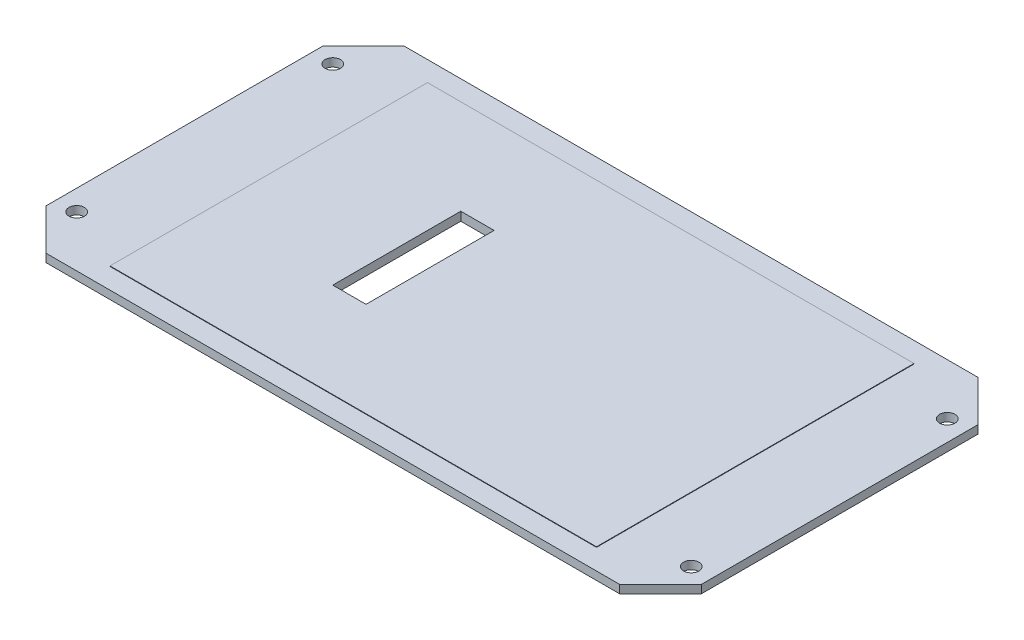
ISO-10303-21;
HEADER;
FILE_DESCRIPTION(('STEP AP214'),'2;1');
FILE_NAME('part.step','',(''),(''),'','','');
FILE_SCHEMA(('AUTOMOTIVE_DESIGN { 1 0 10303 214 1 1 1 1 }'));
ENDSEC;
DATA;
#1=APPLICATION_CONTEXT('core data for automotive mechanical design processes');
#2=APPLICATION_PROTOCOL_DEFINITION('international standard','automotive_design',2000,#1);
#3=PRODUCT_CONTEXT('',#1,'mechanical');
#4=PRODUCT('Part','Part','',(#3));
#5=PRODUCT_RELATED_PRODUCT_CATEGORY('part','',(#4));
#6=PRODUCT_DEFINITION_FORMATION('','',#4);
#7=PRODUCT_DEFINITION_CONTEXT('part definition',#1,'design');
#8=PRODUCT_DEFINITION('design','',#6,#7);
#9=PRODUCT_DEFINITION_SHAPE('','',#8);
#10=(LENGTH_UNIT() NAMED_UNIT(*) SI_UNIT(.MILLI.,.METRE.));
#11=(NAMED_UNIT(*) PLANE_ANGLE_UNIT() SI_UNIT($,.RADIAN.));
#12=(NAMED_UNIT(*) SI_UNIT($,.STERADIAN.) SOLID_ANGLE_UNIT());
#13=UNCERTAINTY_MEASURE_WITH_UNIT(LENGTH_MEASURE(1.E-05),#10,'distance_accuracy_value','');
#14=(GEOMETRIC_REPRESENTATION_CONTEXT(3) GLOBAL_UNCERTAINTY_ASSIGNED_CONTEXT((#13)) GLOBAL_UNIT_ASSIGNED_CONTEXT((#10,
#11,#12)) REPRESENTATION_CONTEXT('',''));
#15=CARTESIAN_POINT('',(0.,0.,0.));
#16=DIRECTION('',(0.,0.,1.));
#17=DIRECTION('',(1.,0.,0.));
#18=AXIS2_PLACEMENT_3D('',#15,#16,#17);
#19=CARTESIAN_POINT('',(1.77641068054053E-13,-25.4,0.));
#20=DIRECTION('',(0.,1.,0.));
#21=DIRECTION('',(-1.,0.,0.));
#22=AXIS2_PLACEMENT_3D('',#19,#20,#21);
#23=PLANE('',#22);
#24=CARTESIAN_POINT('',(-59.9999999999998,-25.4000000000004,25.));
#25=DIRECTION('',(0.,1.,0.));
#26=DIRECTION('',(0.,0.,1.));
#27=AXIS2_PLACEMENT_3D('',#24,#25,#26);
#28=CIRCLE('',#27,1.5);
#29=CARTESIAN_POINT('',(-59.9999999999998,-25.4000000000004,26.5));
#30=VERTEX_POINT('',#29);
#31=EDGE_CURVE('E214',#30,#30,#28,.T.);
#32=ORIENTED_EDGE('',*,*,#31,.F.);
#33=EDGE_LOOP('',(#32));
#34=FACE_BOUND('',#33,.T.);
#35=CARTESIAN_POINT('',(-59.9999999999998,-25.4000000000004,-25.));
#36=DIRECTION('',(0.,1.,0.));
#37=DIRECTION('',(0.,0.,1.));
#38=AXIS2_PLACEMENT_3D('',#35,#36,#37);
#39=CIRCLE('',#38,1.5);
#40=CARTESIAN_POINT('',(-59.9999999999998,-25.4000000000004,-23.5));
#41=VERTEX_POINT('',#40);
#42=EDGE_CURVE('E220',#41,#41,#39,.T.);
#43=ORIENTED_EDGE('',*,*,#42,.F.);
#44=EDGE_LOOP('',(#43));
#45=FACE_BOUND('',#44,.T.);
#46=CARTESIAN_POINT('',(60.0000000000002,-25.3999999999996,-25.));
#47=DIRECTION('',(0.,1.,0.));
#48=DIRECTION('',(0.,0.,1.));
#49=AXIS2_PLACEMENT_3D('',#46,#47,#48);
#50=CIRCLE('',#49,1.5);
#51=CARTESIAN_POINT('',(60.0000000000002,-25.3999999999996,-23.5));
#52=VERTEX_POINT('',#51);
#53=EDGE_CURVE('E226',#52,#52,#50,.T.);
#54=ORIENTED_EDGE('',*,*,#53,.F.);
#55=EDGE_LOOP('',(#54));
#56=FACE_BOUND('',#55,.T.);
#57=CARTESIAN_POINT('',(60.0000000000002,-25.3999999999996,25.));
#58=DIRECTION('',(0.,1.,0.));
#59=DIRECTION('',(0.,0.,1.));
#60=AXIS2_PLACEMENT_3D('',#57,#58,#59);
#61=CIRCLE('',#60,1.5);
#62=CARTESIAN_POINT('',(60.0000000000002,-25.3999999999996,26.5));
#63=VERTEX_POINT('',#62);
#64=EDGE_CURVE('E232',#63,#63,#61,.T.);
#65=ORIENTED_EDGE('',*,*,#64,.F.);
#66=EDGE_LOOP('',(#65));
#67=FACE_BOUND('',#66,.T.);
#68=DIRECTION('',(-1.,0.,0.));
#69=VECTOR('',#68,1.);
#70=CARTESIAN_POINT('',(-63.9999999999999,-25.4000000000004,-35.));
#71=LINE('',#70,#69);
#72=CARTESIAN_POINT('',(56.0000000000002,-25.3999999999996,-35.));
#73=VERTEX_POINT('',#72);
#74=CARTESIAN_POINT('',(-55.9999999999998,-25.4000000000004,-35.));
#75=VERTEX_POINT('',#74);
#76=EDGE_CURVE('E242',#73,#75,#71,.T.);
#77=ORIENTED_EDGE('',*,*,#76,.T.);
#78=DIRECTION('',(0.707106781186549,0.,-0.707106781186546));
#79=VECTOR('',#78,1.);
#80=CARTESIAN_POINT('',(-45.4999999999997,-25.4000000000003,-45.5000000000001));
#81=LINE('',#80,#79);
#82=CARTESIAN_POINT('',(-63.9999999999999,-25.4000000000004,-27.));
#83=VERTEX_POINT('',#82);
#84=EDGE_CURVE('E286',#75,#83,#81,.F.);
#85=ORIENTED_EDGE('',*,*,#84,.T.);
#86=DIRECTION('',(0.,0.,1.));
#87=VECTOR('',#86,1.);
#88=CARTESIAN_POINT('',(-63.9999999999999,-25.4000000000004,-35.));
#89=LINE('',#88,#87);
#90=CARTESIAN_POINT('',(-63.9999999999999,-25.4000000000004,26.9999999999999));
#91=VERTEX_POINT('',#90);
#92=EDGE_CURVE('E246',#83,#91,#89,.T.);
#93=ORIENTED_EDGE('',*,*,#92,.T.);
#94=DIRECTION('',(-0.707106781186546,0.,-0.707106781186549));
#95=VECTOR('',#94,1.);
#96=CARTESIAN_POINT('',(-45.5,-25.4000000000003,45.4999999999999));
#97=LINE('',#96,#95);
#98=CARTESIAN_POINT('',(-55.9999999999998,-25.4000000000004,35.));
#99=VERTEX_POINT('',#98);
#100=EDGE_CURVE('E284',#91,#99,#97,.F.);
#101=ORIENTED_EDGE('',*,*,#100,.T.);
#102=DIRECTION('',(1.,0.,0.));
#103=VECTOR('',#102,1.);
#104=CARTESIAN_POINT('',(-63.9999999999999,-25.4000000000004,35.));
#105=LINE('',#104,#103);
#106=CARTESIAN_POINT('',(56.0000000000001,-25.3999999999996,35.));
#107=VERTEX_POINT('',#106);
#108=EDGE_CURVE('E249',#99,#107,#105,.T.);
#109=ORIENTED_EDGE('',*,*,#108,.T.);
#110=DIRECTION('',(-0.707106781186549,0.,0.707106781186546));
#111=VECTOR('',#110,1.);
#112=CARTESIAN_POINT('',(45.5,-25.3999999999997,45.5000000000001));
#113=LINE('',#112,#111);
#114=CARTESIAN_POINT('',(64.0000000000002,-25.3999999999996,27.));
#115=VERTEX_POINT('',#114);
#116=EDGE_CURVE('E282',#107,#115,#113,.F.);
#117=ORIENTED_EDGE('',*,*,#116,.T.);
#118=DIRECTION('',(0.,0.,-1.));
#119=VECTOR('',#118,1.);
#120=CARTESIAN_POINT('',(64.0000000000002,-25.3999999999996,-35.));
#121=LINE('',#120,#119);
#122=CARTESIAN_POINT('',(64.0000000000002,-25.3999999999996,-27.));
#123=VERTEX_POINT('',#122);
#124=EDGE_CURVE('E239',#115,#123,#121,.T.);
#125=ORIENTED_EDGE('',*,*,#124,.T.);
#126=DIRECTION('',(0.707106781186546,0.,0.707106781186549));
#127=VECTOR('',#126,1.);
#128=CARTESIAN_POINT('',(45.5000000000003,-25.3999999999997,-45.4999999999999));
#129=LINE('',#128,#127);
#130=EDGE_CURVE('E280',#123,#73,#129,.F.);
#131=ORIENTED_EDGE('',*,*,#130,.T.);
#132=EDGE_LOOP('',(#77,#85,#93,#101,#109,#117,#125,#131));
#133=FACE_BOUND('',#132,.T.);
#134=DIRECTION('',(-1.,0.,0.));
#135=VECTOR('',#134,1.);
#136=CARTESIAN_POINT('',(-47.4999999999998,-25.4000000000003,-31.));
#137=LINE('',#136,#135);
#138=CARTESIAN_POINT('',(47.5000000000002,-25.3999999999997,-31.));
#139=VERTEX_POINT('',#138);
#140=CARTESIAN_POINT('',(-47.4999999999998,-25.4000000000003,-31.));
#141=VERTEX_POINT('',#140);
#142=EDGE_CURVE('E199',#139,#141,#137,.T.);
#143=ORIENTED_EDGE('',*,*,#142,.F.);
#144=DIRECTION('',(0.,0.,-1.));
#145=VECTOR('',#144,1.);
#146=CARTESIAN_POINT('',(47.5000000000002,-25.3999999999997,-31.));
#147=LINE('',#146,#145);
#148=CARTESIAN_POINT('',(47.5000000000002,-25.3999999999997,31.));
#149=VERTEX_POINT('',#148);
#150=EDGE_CURVE('E182',#149,#139,#147,.T.);
#151=ORIENTED_EDGE('',*,*,#150,.F.);
#152=DIRECTION('',(1.,0.,0.));
#153=VECTOR('',#152,1.);
#154=CARTESIAN_POINT('',(-47.4999999999998,-25.4000000000003,31.));
#155=LINE('',#154,#153);
#156=CARTESIAN_POINT('',(-47.4999999999998,-25.4000000000003,31.));
#157=VERTEX_POINT('',#156);
#158=EDGE_CURVE('E190',#157,#149,#155,.T.);
#159=ORIENTED_EDGE('',*,*,#158,.F.);
#160=DIRECTION('',(0.,0.,1.));
#161=VECTOR('',#160,1.);
#162=CARTESIAN_POINT('',(-47.4999999999998,-25.4000000000003,-31.));
#163=LINE('',#162,#161);
#164=EDGE_CURVE('E201',#141,#157,#163,.T.);
#165=ORIENTED_EDGE('',*,*,#164,.F.);
#166=EDGE_LOOP('',(#143,#151,#159,#165));
#167=FACE_BOUND('',#166,.T.);
#168=ADVANCED_FACE('F35',(#34,#45,#56,#67,#133,#167),#23,.T.);
#169=CARTESIAN_POINT('',(64.0000000000002,-25.3999999999996,-35.));
#170=DIRECTION('',(-1.,0.,0.));
#171=DIRECTION('',(0.,-1.,0.));
#172=AXIS2_PLACEMENT_3D('',#169,#170,#171);
#173=PLANE('',#172);
#174=ORIENTED_EDGE('',*,*,#124,.F.);
#175=DIRECTION('',(0.,-1.,0.));
#176=VECTOR('',#175,1.);
#177=CARTESIAN_POINT('',(64.0000000000002,-25.3999999999996,27.));
#178=LINE('',#177,#176);
#179=CARTESIAN_POINT('',(64.0000000000002,-26.9999999999996,27.));
#180=VERTEX_POINT('',#179);
#181=EDGE_CURVE('E11',#115,#180,#178,.T.);
#182=ORIENTED_EDGE('',*,*,#181,.T.);
#183=DIRECTION('',(0.,0.,-1.));
#184=VECTOR('',#183,1.);
#185=CARTESIAN_POINT('',(64.0000000000002,-26.9999999999996,-35.));
#186=LINE('',#185,#184);
#187=CARTESIAN_POINT('',(64.0000000000002,-26.9999999999996,-27.));
#188=VERTEX_POINT('',#187);
#189=EDGE_CURVE('E238',#180,#188,#186,.T.);
#190=ORIENTED_EDGE('',*,*,#189,.T.);
#191=DIRECTION('',(0.,1.,0.));
#192=VECTOR('',#191,1.);
#193=CARTESIAN_POINT('',(64.0000000000002,-25.3999999999996,-27.));
#194=LINE('',#193,#192);
#195=EDGE_CURVE('E44',#188,#123,#194,.T.);
#196=ORIENTED_EDGE('',*,*,#195,.T.);
#197=EDGE_LOOP('',(#174,#182,#190,#196));
#198=FACE_BOUND('',#197,.T.);
#199=ADVANCED_FACE('F295',(#198),#173,.F.);
#200=CARTESIAN_POINT('',(-63.9999999999999,-25.4000000000004,-35.));
#201=DIRECTION('',(0.,0.,1.));
#202=DIRECTION('',(1.,0.,0.));
#203=AXIS2_PLACEMENT_3D('',#200,#201,#202);
#204=PLANE('',#203);
#205=DIRECTION('',(-1.,0.,0.));
#206=VECTOR('',#205,1.);
#207=CARTESIAN_POINT('',(-63.9999999999998,-27.0000000000004,-35.));
#208=LINE('',#207,#206);
#209=CARTESIAN_POINT('',(56.0000000000002,-26.9999999999996,-35.));
#210=VERTEX_POINT('',#209);
#211=CARTESIAN_POINT('',(-55.9999999999998,-27.0000000000004,-35.));
#212=VERTEX_POINT('',#211);
#213=EDGE_CURVE('E255',#210,#212,#208,.T.);
#214=ORIENTED_EDGE('',*,*,#213,.T.);
#215=DIRECTION('',(0.,1.,0.));
#216=VECTOR('',#215,1.);
#217=CARTESIAN_POINT('',(-55.9999999999998,-25.4000000000004,-35.));
#218=LINE('',#217,#216);
#219=EDGE_CURVE('E278',#212,#75,#218,.T.);
#220=ORIENTED_EDGE('',*,*,#219,.T.);
#221=ORIENTED_EDGE('',*,*,#76,.F.);
#222=DIRECTION('',(0.,-1.,0.));
#223=VECTOR('',#222,1.);
#224=CARTESIAN_POINT('',(56.0000000000002,-25.3999999999996,-35.));
#225=LINE('',#224,#223);
#226=EDGE_CURVE('E275',#73,#210,#225,.T.);
#227=ORIENTED_EDGE('',*,*,#226,.T.);
#228=EDGE_LOOP('',(#214,#220,#221,#227));
#229=FACE_BOUND('',#228,.T.);
#230=ADVANCED_FACE('F307',(#229),#204,.F.);
#231=CARTESIAN_POINT('',(-63.9999999999999,-25.4000000000004,-35.));
#232=DIRECTION('',(1.,0.,0.));
#233=DIRECTION('',(0.,1.,0.));
#234=AXIS2_PLACEMENT_3D('',#231,#232,#233);
#235=PLANE('',#234);
#236=ORIENTED_EDGE('',*,*,#92,.F.);
#237=DIRECTION('',(0.,-1.,0.));
#238=VECTOR('',#237,1.);
#239=CARTESIAN_POINT('',(-63.9999999999999,-25.4000000000004,-27.));
#240=LINE('',#239,#238);
#241=CARTESIAN_POINT('',(-63.9999999999998,-27.0000000000004,-27.));
#242=VERTEX_POINT('',#241);
#243=EDGE_CURVE('E264',#83,#242,#240,.T.);
#244=ORIENTED_EDGE('',*,*,#243,.T.);
#245=DIRECTION('',(0.,0.,1.));
#246=VECTOR('',#245,1.);
#247=CARTESIAN_POINT('',(-63.9999999999998,-27.0000000000004,-35.));
#248=LINE('',#247,#246);
#249=CARTESIAN_POINT('',(-63.9999999999998,-27.0000000000004,26.9999999999999));
#250=VERTEX_POINT('',#249);
#251=EDGE_CURVE('E258',#242,#250,#248,.T.);
#252=ORIENTED_EDGE('',*,*,#251,.T.);
#253=DIRECTION('',(0.,1.,0.));
#254=VECTOR('',#253,1.);
#255=CARTESIAN_POINT('',(-63.9999999999999,-25.4000000000004,26.9999999999999));
#256=LINE('',#255,#254);
#257=EDGE_CURVE('E252',#250,#91,#256,.T.);
#258=ORIENTED_EDGE('',*,*,#257,.T.);
#259=EDGE_LOOP('',(#236,#244,#252,#258));
#260=FACE_BOUND('',#259,.T.);
#261=ADVANCED_FACE('F318',(#260),#235,.F.);
#262=CARTESIAN_POINT('',(-63.9999999999999,-25.4000000000004,35.));
#263=DIRECTION('',(0.,0.,-1.));
#264=DIRECTION('',(-1.,0.,0.));
#265=AXIS2_PLACEMENT_3D('',#262,#263,#264);
#266=PLANE('',#265);
#267=ORIENTED_EDGE('',*,*,#108,.F.);
#268=DIRECTION('',(0.,-1.,0.));
#269=VECTOR('',#268,1.);
#270=CARTESIAN_POINT('',(-55.9999999999998,-25.4000000000004,35.));
#271=LINE('',#270,#269);
#272=CARTESIAN_POINT('',(-55.9999999999998,-27.0000000000004,35.));
#273=VERTEX_POINT('',#272);
#274=EDGE_CURVE('E290',#99,#273,#271,.T.);
#275=ORIENTED_EDGE('',*,*,#274,.T.);
#276=DIRECTION('',(1.,0.,0.));
#277=VECTOR('',#276,1.);
#278=CARTESIAN_POINT('',(-63.9999999999998,-27.0000000000004,35.));
#279=LINE('',#278,#277);
#280=CARTESIAN_POINT('',(56.0000000000002,-26.9999999999996,35.));
#281=VERTEX_POINT('',#280);
#282=EDGE_CURVE('E243',#273,#281,#279,.T.);
#283=ORIENTED_EDGE('',*,*,#282,.T.);
#284=DIRECTION('',(0.,1.,0.));
#285=VECTOR('',#284,1.);
#286=CARTESIAN_POINT('',(56.0000000000001,-25.3999999999996,35.));
#287=LINE('',#286,#285);
#288=EDGE_CURVE('E288',#281,#107,#287,.T.);
#289=ORIENTED_EDGE('',*,*,#288,.T.);
#290=EDGE_LOOP('',(#267,#275,#283,#289));
#291=FACE_BOUND('',#290,.T.);
#292=ADVANCED_FACE('F327',(#291),#266,.F.);
#293=CARTESIAN_POINT('',(1.88813808338351E-13,-27.,0.));
#294=DIRECTION('',(0.,1.,0.));
#295=DIRECTION('',(-1.,0.,0.));
#296=AXIS2_PLACEMENT_3D('',#293,#294,#295);
#297=PLANE('',#296);
#298=DIRECTION('',(-1.,0.,0.));
#299=VECTOR('',#298,1.);
#300=CARTESIAN_POINT('',(-22.4999999999998,-27.0000000000002,12.5));
#301=LINE('',#300,#299);
#302=CARTESIAN_POINT('',(-15.9999999999998,-27.0000000000001,12.5));
#303=VERTEX_POINT('',#302);
#304=CARTESIAN_POINT('',(-22.4999999999998,-27.0000000000002,12.5));
#305=VERTEX_POINT('',#304);
#306=EDGE_CURVE('E176',#303,#305,#301,.T.);
#307=ORIENTED_EDGE('',*,*,#306,.F.);
#308=DIRECTION('',(0.,0.,1.));
#309=VECTOR('',#308,1.);
#310=CARTESIAN_POINT('',(-15.9999999999998,-27.0000000000001,12.5));
#311=LINE('',#310,#309);
#312=CARTESIAN_POINT('',(-15.9999999999998,-27.0000000000001,-12.5));
#313=VERTEX_POINT('',#312);
#314=EDGE_CURVE('E51',#313,#303,#311,.T.);
#315=ORIENTED_EDGE('',*,*,#314,.F.);
#316=DIRECTION('',(1.,0.,0.));
#317=VECTOR('',#316,1.);
#318=CARTESIAN_POINT('',(-22.4999999999998,-27.0000000000002,-12.5));
#319=LINE('',#318,#317);
#320=CARTESIAN_POINT('',(-22.4999999999998,-27.0000000000002,-12.5));
#321=VERTEX_POINT('',#320);
#322=EDGE_CURVE('E167',#321,#313,#319,.T.);
#323=ORIENTED_EDGE('',*,*,#322,.F.);
#324=DIRECTION('',(0.,0.,-1.));
#325=VECTOR('',#324,1.);
#326=CARTESIAN_POINT('',(-22.4999999999998,-27.0000000000002,12.5));
#327=LINE('',#326,#325);
#328=EDGE_CURVE('E170',#305,#321,#327,.T.);
#329=ORIENTED_EDGE('',*,*,#328,.F.);
#330=EDGE_LOOP('',(#307,#315,#323,#329));
#331=FACE_BOUND('',#330,.T.);
#332=CARTESIAN_POINT('',(-59.9999999999998,-27.0000000000013,25.));
#333=DIRECTION('',(0.,1.,0.));
#334=DIRECTION('',(0.,0.,1.));
#335=AXIS2_PLACEMENT_3D('',#332,#333,#334);
#336=CIRCLE('',#335,1.5);
#337=CARTESIAN_POINT('',(-59.9999999999998,-27.0000000000013,26.5));
#338=VERTEX_POINT('',#337);
#339=EDGE_CURVE('E217',#338,#338,#336,.T.);
#340=ORIENTED_EDGE('',*,*,#339,.T.);
#341=EDGE_LOOP('',(#340));
#342=FACE_BOUND('',#341,.T.);
#343=CARTESIAN_POINT('',(-59.9999999999998,-27.0000000000013,-25.));
#344=DIRECTION('',(0.,1.,0.));
#345=DIRECTION('',(0.,0.,1.));
#346=AXIS2_PLACEMENT_3D('',#343,#344,#345);
#347=CIRCLE('',#346,1.5);
#348=CARTESIAN_POINT('',(-59.9999999999998,-27.0000000000013,-23.5));
#349=VERTEX_POINT('',#348);
#350=EDGE_CURVE('E223',#349,#349,#347,.T.);
#351=ORIENTED_EDGE('',*,*,#350,.T.);
#352=EDGE_LOOP('',(#351));
#353=FACE_BOUND('',#352,.T.);
#354=CARTESIAN_POINT('',(60.0000000000002,-27.0000000000005,-25.));
#355=DIRECTION('',(0.,1.,0.));
#356=DIRECTION('',(0.,0.,1.));
#357=AXIS2_PLACEMENT_3D('',#354,#355,#356);
#358=CIRCLE('',#357,1.5);
#359=CARTESIAN_POINT('',(60.0000000000002,-27.0000000000005,-23.5));
#360=VERTEX_POINT('',#359);
#361=EDGE_CURVE('E229',#360,#360,#358,.T.);
#362=ORIENTED_EDGE('',*,*,#361,.T.);
#363=EDGE_LOOP('',(#362));
#364=FACE_BOUND('',#363,.T.);
#365=CARTESIAN_POINT('',(60.0000000000002,-27.0000000000005,25.));
#366=DIRECTION('',(0.,1.,0.));
#367=DIRECTION('',(0.,0.,1.));
#368=AXIS2_PLACEMENT_3D('',#365,#366,#367);
#369=CIRCLE('',#368,1.5);
#370=CARTESIAN_POINT('',(60.0000000000002,-27.0000000000005,26.5));
#371=VERTEX_POINT('',#370);
#372=EDGE_CURVE('E235',#371,#371,#369,.T.);
#373=ORIENTED_EDGE('',*,*,#372,.T.);
#374=EDGE_LOOP('',(#373));
#375=FACE_BOUND('',#374,.T.);
#376=ORIENTED_EDGE('',*,*,#251,.F.);
#377=DIRECTION('',(-0.707106781186549,0.,0.707106781186546));
#378=VECTOR('',#377,1.);
#379=CARTESIAN_POINT('',(-63.9999999999998,-27.0000000000004,-27.));
#380=LINE('',#379,#378);
#381=EDGE_CURVE('E273',#242,#212,#380,.F.);
#382=ORIENTED_EDGE('',*,*,#381,.T.);
#383=ORIENTED_EDGE('',*,*,#213,.F.);
#384=DIRECTION('',(-0.707106781186546,0.,-0.707106781186549));
#385=VECTOR('',#384,1.);
#386=CARTESIAN_POINT('',(56.0000000000002,-26.9999999999996,-35.));
#387=LINE('',#386,#385);
#388=EDGE_CURVE('E267',#210,#188,#387,.F.);
#389=ORIENTED_EDGE('',*,*,#388,.T.);
#390=ORIENTED_EDGE('',*,*,#189,.F.);
#391=DIRECTION('',(0.707106781186549,0.,-0.707106781186546));
#392=VECTOR('',#391,1.);
#393=CARTESIAN_POINT('',(64.0000000000002,-26.9999999999996,27.));
#394=LINE('',#393,#392);
#395=EDGE_CURVE('E269',#180,#281,#394,.F.);
#396=ORIENTED_EDGE('',*,*,#395,.T.);
#397=ORIENTED_EDGE('',*,*,#282,.F.);
#398=DIRECTION('',(0.707106781186546,0.,0.707106781186549));
#399=VECTOR('',#398,1.);
#400=CARTESIAN_POINT('',(-55.9999999999998,-27.0000000000004,35.));
#401=LINE('',#400,#399);
#402=EDGE_CURVE('E271',#273,#250,#401,.F.);
#403=ORIENTED_EDGE('',*,*,#402,.T.);
#404=EDGE_LOOP('',(#376,#382,#383,#389,#390,#396,#397,#403));
#405=FACE_BOUND('',#404,.T.);
#406=ADVANCED_FACE('F311',(#331,#342,#353,#364,#375,#405),#297,.F.);
#407=CARTESIAN_POINT('',(-63.9999999999999,-25.4000000000004,-27.));
#408=DIRECTION('',(0.707106781186546,0.,0.707106781186549));
#409=DIRECTION('',(0.,-1.,0.));
#410=AXIS2_PLACEMENT_3D('',#407,#408,#409);
#411=PLANE('',#410);
#412=ORIENTED_EDGE('',*,*,#84,.F.);
#413=ORIENTED_EDGE('',*,*,#219,.F.);
#414=ORIENTED_EDGE('',*,*,#381,.F.);
#415=ORIENTED_EDGE('',*,*,#243,.F.);
#416=EDGE_LOOP('',(#412,#413,#414,#415));
#417=FACE_BOUND('',#416,.T.);
#418=ADVANCED_FACE('F315',(#417),#411,.F.);
#419=CARTESIAN_POINT('',(-55.9999999999998,-25.4000000000004,35.));
#420=DIRECTION('',(0.707106781186549,0.,-0.707106781186546));
#421=DIRECTION('',(0.,-1.,0.));
#422=AXIS2_PLACEMENT_3D('',#419,#420,#421);
#423=PLANE('',#422);
#424=ORIENTED_EDGE('',*,*,#100,.F.);
#425=ORIENTED_EDGE('',*,*,#257,.F.);
#426=ORIENTED_EDGE('',*,*,#402,.F.);
#427=ORIENTED_EDGE('',*,*,#274,.F.);
#428=EDGE_LOOP('',(#424,#425,#426,#427));
#429=FACE_BOUND('',#428,.T.);
#430=ADVANCED_FACE('F324',(#429),#423,.F.);
#431=CARTESIAN_POINT('',(64.0000000000002,-25.3999999999996,27.));
#432=DIRECTION('',(-0.707106781186546,0.,-0.707106781186549));
#433=DIRECTION('',(0.,-1.,0.));
#434=AXIS2_PLACEMENT_3D('',#431,#432,#433);
#435=PLANE('',#434);
#436=ORIENTED_EDGE('',*,*,#116,.F.);
#437=ORIENTED_EDGE('',*,*,#288,.F.);
#438=ORIENTED_EDGE('',*,*,#395,.F.);
#439=ORIENTED_EDGE('',*,*,#181,.F.);
#440=EDGE_LOOP('',(#436,#437,#438,#439));
#441=FACE_BOUND('',#440,.T.);
#442=ADVANCED_FACE('F330',(#441),#435,.F.);
#443=CARTESIAN_POINT('',(56.0000000000002,-25.3999999999996,-35.));
#444=DIRECTION('',(-0.707106781186549,0.,0.707106781186546));
#445=DIRECTION('',(0.,-1.,0.));
#446=AXIS2_PLACEMENT_3D('',#443,#444,#445);
#447=PLANE('',#446);
#448=ORIENTED_EDGE('',*,*,#130,.F.);
#449=ORIENTED_EDGE('',*,*,#195,.F.);
#450=ORIENTED_EDGE('',*,*,#388,.F.);
#451=ORIENTED_EDGE('',*,*,#226,.F.);
#452=EDGE_LOOP('',(#448,#449,#450,#451));
#453=FACE_BOUND('',#452,.T.);
#454=ADVANCED_FACE('F38',(#453),#447,.F.);
#455=CARTESIAN_POINT('',(60.0000000000002,-25.3999999999996,25.));
#456=DIRECTION('',(0.,1.,0.));
#457=DIRECTION('',(0.,0.,1.));
#458=AXIS2_PLACEMENT_3D('',#455,#456,#457);
#459=CYLINDRICAL_SURFACE('',#458,1.5);
#460=ORIENTED_EDGE('',*,*,#372,.F.);
#461=EDGE_LOOP('',(#460));
#462=FACE_BOUND('',#461,.T.);
#463=ORIENTED_EDGE('',*,*,#64,.T.);
#464=EDGE_LOOP('',(#463));
#465=FACE_BOUND('',#464,.T.);
#466=ADVANCED_FACE('F336',(#462,#465),#459,.F.);
#467=CARTESIAN_POINT('',(60.0000000000002,-25.3999999999996,-25.));
#468=DIRECTION('',(0.,1.,0.));
#469=DIRECTION('',(0.,0.,1.));
#470=AXIS2_PLACEMENT_3D('',#467,#468,#469);
#471=CYLINDRICAL_SURFACE('',#470,1.5);
#472=ORIENTED_EDGE('',*,*,#361,.F.);
#473=EDGE_LOOP('',(#472));
#474=FACE_BOUND('',#473,.T.);
#475=ORIENTED_EDGE('',*,*,#53,.T.);
#476=EDGE_LOOP('',(#475));
#477=FACE_BOUND('',#476,.T.);
#478=ADVANCED_FACE('F399',(#474,#477),#471,.F.);
#479=CARTESIAN_POINT('',(-59.9999999999998,-25.4000000000004,-25.));
#480=DIRECTION('',(0.,1.,0.));
#481=DIRECTION('',(0.,0.,1.));
#482=AXIS2_PLACEMENT_3D('',#479,#480,#481);
#483=CYLINDRICAL_SURFACE('',#482,1.5);
#484=ORIENTED_EDGE('',*,*,#350,.F.);
#485=EDGE_LOOP('',(#484));
#486=FACE_BOUND('',#485,.T.);
#487=ORIENTED_EDGE('',*,*,#42,.T.);
#488=EDGE_LOOP('',(#487));
#489=FACE_BOUND('',#488,.T.);
#490=ADVANCED_FACE('F408',(#486,#489),#483,.F.);
#491=CARTESIAN_POINT('',(-59.9999999999998,-25.4000000000004,25.));
#492=DIRECTION('',(0.,1.,0.));
#493=DIRECTION('',(0.,0.,1.));
#494=AXIS2_PLACEMENT_3D('',#491,#492,#493);
#495=CYLINDRICAL_SURFACE('',#494,1.5);
#496=ORIENTED_EDGE('',*,*,#339,.F.);
#497=EDGE_LOOP('',(#496));
#498=FACE_BOUND('',#497,.T.);
#499=ORIENTED_EDGE('',*,*,#31,.T.);
#500=EDGE_LOOP('',(#499));
#501=FACE_BOUND('',#500,.T.);
#502=ADVANCED_FACE('F417',(#498,#501),#495,.F.);
#503=CARTESIAN_POINT('',(47.5000000000002,-25.2999999999997,-31.));
#504=DIRECTION('',(-1.,0.,0.));
#505=DIRECTION('',(0.,-1.,0.));
#506=AXIS2_PLACEMENT_3D('',#503,#504,#505);
#507=PLANE('',#506);
#508=ORIENTED_EDGE('',*,*,#150,.T.);
#509=DIRECTION('',(0.,-1.,0.));
#510=VECTOR('',#509,1.);
#511=CARTESIAN_POINT('',(47.5000000000002,-25.2999999999997,-31.));
#512=LINE('',#511,#510);
#513=CARTESIAN_POINT('',(47.5000000000002,-25.2999999999997,-31.));
#514=VERTEX_POINT('',#513);
#515=EDGE_CURVE('E212',#514,#139,#512,.T.);
#516=ORIENTED_EDGE('',*,*,#515,.F.);
#517=DIRECTION('',(0.,0.,-1.));
#518=VECTOR('',#517,1.);
#519=CARTESIAN_POINT('',(47.5000000000002,-25.2999999999997,-31.));
#520=LINE('',#519,#518);
#521=CARTESIAN_POINT('',(47.5000000000002,-25.2999999999997,31.));
#522=VERTEX_POINT('',#521);
#523=EDGE_CURVE('E186',#522,#514,#520,.T.);
#524=ORIENTED_EDGE('',*,*,#523,.F.);
#525=DIRECTION('',(0.,-1.,0.));
#526=VECTOR('',#525,1.);
#527=CARTESIAN_POINT('',(47.5000000000002,-25.2999999999997,31.));
#528=LINE('',#527,#526);
#529=EDGE_CURVE('E196',#522,#149,#528,.T.);
#530=ORIENTED_EDGE('',*,*,#529,.T.);
#531=EDGE_LOOP('',(#508,#516,#524,#530));
#532=FACE_BOUND('',#531,.T.);
#533=ADVANCED_FACE('F426',(#532),#507,.F.);
#534=CARTESIAN_POINT('',(-47.4999999999998,-25.3000000000003,-31.));
#535=DIRECTION('',(0.,0.,1.));
#536=DIRECTION('',(0.,-1.,0.));
#537=AXIS2_PLACEMENT_3D('',#534,#535,#536);
#538=PLANE('',#537);
#539=ORIENTED_EDGE('',*,*,#142,.T.);
#540=DIRECTION('',(0.,-1.,0.));
#541=VECTOR('',#540,1.);
#542=CARTESIAN_POINT('',(-47.4999999999998,-25.3000000000003,-31.));
#543=LINE('',#542,#541);
#544=CARTESIAN_POINT('',(-47.4999999999998,-25.3000000000003,-31.));
#545=VERTEX_POINT('',#544);
#546=EDGE_CURVE('E209',#545,#141,#543,.T.);
#547=ORIENTED_EDGE('',*,*,#546,.F.);
#548=DIRECTION('',(-1.,0.,0.));
#549=VECTOR('',#548,1.);
#550=CARTESIAN_POINT('',(-47.4999999999998,-25.3000000000003,-31.));
#551=LINE('',#550,#549);
#552=EDGE_CURVE('E189',#514,#545,#551,.T.);
#553=ORIENTED_EDGE('',*,*,#552,.F.);
#554=ORIENTED_EDGE('',*,*,#515,.T.);
#555=EDGE_LOOP('',(#539,#547,#553,#554));
#556=FACE_BOUND('',#555,.T.);
#557=ADVANCED_FACE('F441',(#556),#538,.F.);
#558=CARTESIAN_POINT('',(-47.4999999999998,-25.3000000000003,-31.));
#559=DIRECTION('',(1.,0.,0.));
#560=DIRECTION('',(0.,1.,0.));
#561=AXIS2_PLACEMENT_3D('',#558,#559,#560);
#562=PLANE('',#561);
#563=ORIENTED_EDGE('',*,*,#164,.T.);
#564=DIRECTION('',(0.,-1.,0.));
#565=VECTOR('',#564,1.);
#566=CARTESIAN_POINT('',(-47.4999999999998,-25.3000000000003,31.));
#567=LINE('',#566,#565);
#568=CARTESIAN_POINT('',(-47.4999999999998,-25.3000000000003,31.));
#569=VERTEX_POINT('',#568);
#570=EDGE_CURVE('E207',#569,#157,#567,.T.);
#571=ORIENTED_EDGE('',*,*,#570,.F.);
#572=DIRECTION('',(0.,0.,1.));
#573=VECTOR('',#572,1.);
#574=CARTESIAN_POINT('',(-47.4999999999998,-25.3000000000003,-31.));
#575=LINE('',#574,#573);
#576=EDGE_CURVE('E192',#545,#569,#575,.T.);
#577=ORIENTED_EDGE('',*,*,#576,.F.);
#578=ORIENTED_EDGE('',*,*,#546,.T.);
#579=EDGE_LOOP('',(#563,#571,#577,#578));
#580=FACE_BOUND('',#579,.T.);
#581=ADVANCED_FACE('F451',(#580),#562,.F.);
#582=CARTESIAN_POINT('',(-47.4999999999998,-25.3000000000003,31.));
#583=DIRECTION('',(0.,0.,-1.));
#584=DIRECTION('',(0.,1.,0.));
#585=AXIS2_PLACEMENT_3D('',#582,#583,#584);
#586=PLANE('',#585);
#587=ORIENTED_EDGE('',*,*,#158,.T.);
#588=ORIENTED_EDGE('',*,*,#529,.F.);
#589=DIRECTION('',(1.,0.,0.));
#590=VECTOR('',#589,1.);
#591=CARTESIAN_POINT('',(-47.4999999999998,-25.3000000000003,31.));
#592=LINE('',#591,#590);
#593=EDGE_CURVE('E194',#569,#522,#592,.T.);
#594=ORIENTED_EDGE('',*,*,#593,.F.);
#595=ORIENTED_EDGE('',*,*,#570,.T.);
#596=EDGE_LOOP('',(#587,#588,#594,#595));
#597=FACE_BOUND('',#596,.T.);
#598=ADVANCED_FACE('F461',(#597),#586,.F.);
#599=CARTESIAN_POINT('',(1.7740383586493E-13,-25.3,0.));
#600=DIRECTION('',(0.,1.,0.));
#601=DIRECTION('',(-1.,0.,0.));
#602=AXIS2_PLACEMENT_3D('',#599,#600,#601);
#603=PLANE('',#602);
#604=DIRECTION('',(0.,0.,1.));
#605=VECTOR('',#604,1.);
#606=CARTESIAN_POINT('',(-15.9999999999998,-25.2999999999993,12.5));
#607=LINE('',#606,#605);
#608=CARTESIAN_POINT('',(-15.9999999999998,-25.2999999999993,-12.5));
#609=VERTEX_POINT('',#608);
#610=CARTESIAN_POINT('',(-15.9999999999998,-25.2999999999993,12.5));
#611=VERTEX_POINT('',#610);
#612=EDGE_CURVE('E151',#609,#611,#607,.T.);
#613=ORIENTED_EDGE('',*,*,#612,.T.);
#614=DIRECTION('',(-1.,0.,0.));
#615=VECTOR('',#614,1.);
#616=CARTESIAN_POINT('',(-22.4999999999998,-25.2999999999994,12.5));
#617=LINE('',#616,#615);
#618=CARTESIAN_POINT('',(-22.4999999999998,-25.3000000000002,12.5));
#619=VERTEX_POINT('',#618);
#620=EDGE_CURVE('E160',#611,#619,#617,.T.);
#621=ORIENTED_EDGE('',*,*,#620,.T.);
#622=DIRECTION('',(0.,0.,-1.));
#623=VECTOR('',#622,1.);
#624=CARTESIAN_POINT('',(-22.4999999999998,-25.2999999999994,12.5));
#625=LINE('',#624,#623);
#626=CARTESIAN_POINT('',(-22.4999999999998,-25.2999999999994,-12.5));
#627=VERTEX_POINT('',#626);
#628=EDGE_CURVE('E59',#619,#627,#625,.T.);
#629=ORIENTED_EDGE('',*,*,#628,.T.);
#630=DIRECTION('',(1.,0.,0.));
#631=VECTOR('',#630,1.);
#632=CARTESIAN_POINT('',(-22.4999999999998,-25.2999999999994,-12.5));
#633=LINE('',#632,#631);
#634=EDGE_CURVE('E157',#627,#609,#633,.T.);
#635=ORIENTED_EDGE('',*,*,#634,.T.);
#636=EDGE_LOOP('',(#613,#621,#629,#635));
#637=FACE_BOUND('',#636,.T.);
#638=ORIENTED_EDGE('',*,*,#523,.T.);
#639=ORIENTED_EDGE('',*,*,#552,.T.);
#640=ORIENTED_EDGE('',*,*,#576,.T.);
#641=ORIENTED_EDGE('',*,*,#593,.T.);
#642=EDGE_LOOP('',(#638,#639,#640,#641));
#643=FACE_BOUND('',#642,.T.);
#644=ADVANCED_FACE('F164',(#637,#643),#603,.T.);
#645=CARTESIAN_POINT('',(-15.9999999999998,-25.2999999999993,12.5));
#646=DIRECTION('',(1.,0.,0.));
#647=DIRECTION('',(0.,1.,0.));
#648=AXIS2_PLACEMENT_3D('',#645,#646,#647);
#649=PLANE('',#648);
#650=ORIENTED_EDGE('',*,*,#314,.T.);
#651=DIRECTION('',(0.,-1.,0.));
#652=VECTOR('',#651,1.);
#653=CARTESIAN_POINT('',(-15.9999999999998,-25.2999999999993,12.5));
#654=LINE('',#653,#652);
#655=EDGE_CURVE('E147',#611,#303,#654,.T.);
#656=ORIENTED_EDGE('',*,*,#655,.F.);
#657=ORIENTED_EDGE('',*,*,#612,.F.);
#658=DIRECTION('',(0.,-1.,0.));
#659=VECTOR('',#658,1.);
#660=CARTESIAN_POINT('',(-15.9999999999998,-25.2999999999993,-12.5));
#661=LINE('',#660,#659);
#662=EDGE_CURVE('E180',#609,#313,#661,.T.);
#663=ORIENTED_EDGE('',*,*,#662,.T.);
#664=EDGE_LOOP('',(#650,#656,#657,#663));
#665=FACE_BOUND('',#664,.T.);
#666=ADVANCED_FACE('F149',(#665),#649,.F.);
#667=CARTESIAN_POINT('',(-22.4999999999998,-25.2999999999994,-12.5));
#668=DIRECTION('',(0.,0.,-1.));
#669=DIRECTION('',(-1.,0.,0.));
#670=AXIS2_PLACEMENT_3D('',#667,#668,#669);
#671=PLANE('',#670);
#672=ORIENTED_EDGE('',*,*,#322,.T.);
#673=ORIENTED_EDGE('',*,*,#662,.F.);
#674=ORIENTED_EDGE('',*,*,#634,.F.);
#675=DIRECTION('',(0.,-1.,0.));
#676=VECTOR('',#675,1.);
#677=CARTESIAN_POINT('',(-22.4999999999998,-25.2999999999994,-12.5));
#678=LINE('',#677,#676);
#679=EDGE_CURVE('E183',#627,#321,#678,.T.);
#680=ORIENTED_EDGE('',*,*,#679,.T.);
#681=EDGE_LOOP('',(#672,#673,#674,#680));
#682=FACE_BOUND('',#681,.T.);
#683=ADVANCED_FACE('F493',(#682),#671,.F.);
#684=CARTESIAN_POINT('',(-22.4999999999998,-25.2999999999994,12.5));
#685=DIRECTION('',(-1.,0.,0.));
#686=DIRECTION('',(0.,-1.,0.));
#687=AXIS2_PLACEMENT_3D('',#684,#685,#686);
#688=PLANE('',#687);
#689=ORIENTED_EDGE('',*,*,#328,.T.);
#690=ORIENTED_EDGE('',*,*,#679,.F.);
#691=ORIENTED_EDGE('',*,*,#628,.F.);
#692=DIRECTION('',(0.,-1.,0.));
#693=VECTOR('',#692,1.);
#694=CARTESIAN_POINT('',(-22.4999999999998,-25.2999999999994,12.5));
#695=LINE('',#694,#693);
#696=EDGE_CURVE('E156',#619,#305,#695,.T.);
#697=ORIENTED_EDGE('',*,*,#696,.T.);
#698=EDGE_LOOP('',(#689,#690,#691,#697));
#699=FACE_BOUND('',#698,.T.);
#700=ADVANCED_FACE('F502',(#699),#688,.F.);
#701=CARTESIAN_POINT('',(-22.4999999999998,-25.2999999999994,12.5));
#702=DIRECTION('',(0.,0.,1.));
#703=DIRECTION('',(1.,0.,0.));
#704=AXIS2_PLACEMENT_3D('',#701,#702,#703);
#705=PLANE('',#704);
#706=ORIENTED_EDGE('',*,*,#306,.T.);
#707=ORIENTED_EDGE('',*,*,#696,.F.);
#708=ORIENTED_EDGE('',*,*,#620,.F.);
#709=ORIENTED_EDGE('',*,*,#655,.T.);
#710=EDGE_LOOP('',(#706,#707,#708,#709));
#711=FACE_BOUND('',#710,.T.);
#712=ADVANCED_FACE('F161',(#711),#705,.F.);
#713=CLOSED_SHELL('',(#168,#199,#230,#261,#292,#406,#418,#430,#442,#454,#466,#478,#490,#502,
#533,#557,#581,#598,#644,#666,#683,#700,#712));
#714=MANIFOLD_SOLID_BREP('B2',#713);
#715=ADVANCED_BREP_SHAPE_REPRESENTATION('',(#18,#714),#14);
#716=SHAPE_DEFINITION_REPRESENTATION(#9,#715);
ENDSEC;
END-ISO-10303-21;
